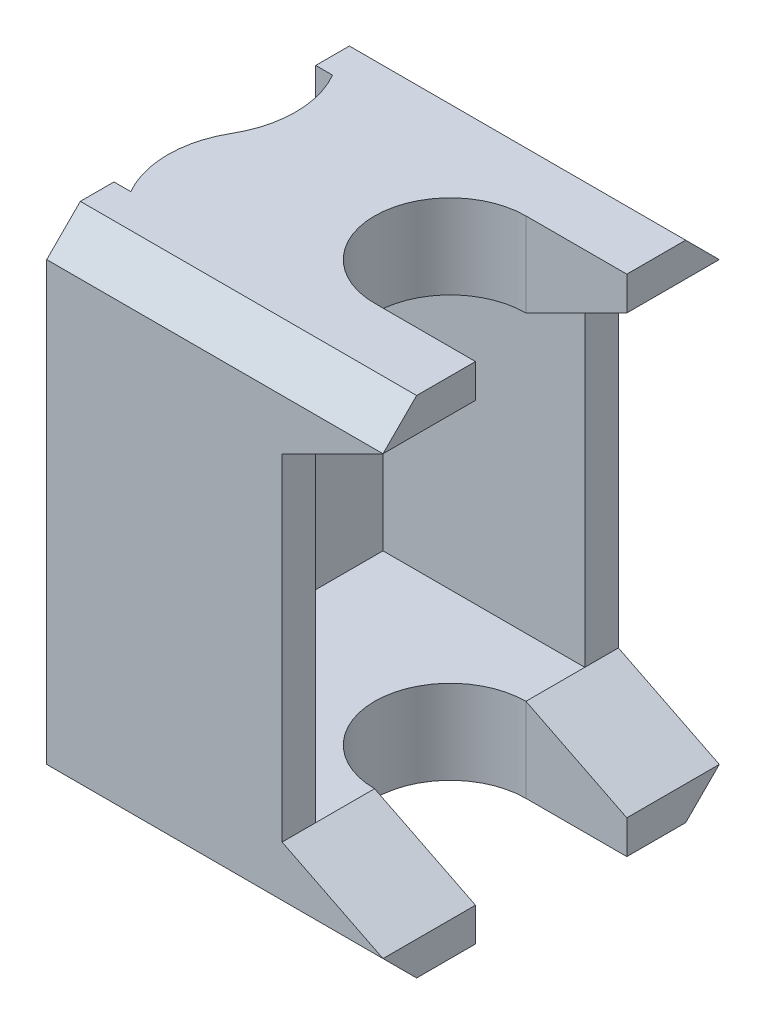
ISO-10303-21;
HEADER;
FILE_DESCRIPTION(('STEP AP214'),'2;1');
FILE_NAME('part.step','',(''),(''),'','','');
FILE_SCHEMA(('AUTOMOTIVE_DESIGN { 1 0 10303 214 1 1 1 1 }'));
ENDSEC;
DATA;
#1=APPLICATION_CONTEXT('core data for automotive mechanical design processes');
#2=APPLICATION_PROTOCOL_DEFINITION('international standard','automotive_design',2000,#1);
#3=PRODUCT_CONTEXT('',#1,'mechanical');
#4=PRODUCT('Part','Part','',(#3));
#5=PRODUCT_RELATED_PRODUCT_CATEGORY('part','',(#4));
#6=PRODUCT_DEFINITION_FORMATION('','',#4);
#7=PRODUCT_DEFINITION_CONTEXT('part definition',#1,'design');
#8=PRODUCT_DEFINITION('design','',#6,#7);
#9=PRODUCT_DEFINITION_SHAPE('','',#8);
#10=(LENGTH_UNIT() NAMED_UNIT(*) SI_UNIT(.MILLI.,.METRE.));
#11=(NAMED_UNIT(*) PLANE_ANGLE_UNIT() SI_UNIT($,.RADIAN.));
#12=(NAMED_UNIT(*) SI_UNIT($,.STERADIAN.) SOLID_ANGLE_UNIT());
#13=UNCERTAINTY_MEASURE_WITH_UNIT(LENGTH_MEASURE(1.E-05),#10,'distance_accuracy_value','');
#14=(GEOMETRIC_REPRESENTATION_CONTEXT(3) GLOBAL_UNCERTAINTY_ASSIGNED_CONTEXT((#13)) GLOBAL_UNIT_ASSIGNED_CONTEXT((#10,
#11,#12)) REPRESENTATION_CONTEXT('',''));
#15=CARTESIAN_POINT('',(0.,0.,0.));
#16=DIRECTION('',(0.,0.,1.));
#17=DIRECTION('',(1.,0.,0.));
#18=AXIS2_PLACEMENT_3D('',#15,#16,#17);
#19=CARTESIAN_POINT('',(-30.,0.,0.));
#20=DIRECTION('',(0.,1.,0.));
#21=DIRECTION('',(-1.,0.,0.));
#22=AXIS2_PLACEMENT_3D('',#19,#20,#21);
#23=CYLINDRICAL_SURFACE('',#22,22.5);
#24=CARTESIAN_POINT('',(-30.,125.,0.));
#25=DIRECTION('',(0.,1.,0.));
#26=DIRECTION('',(0.,0.,1.));
#27=AXIS2_PLACEMENT_3D('',#24,#25,#26);
#28=CIRCLE('',#27,22.5);
#29=CARTESIAN_POINT('',(-30.,125.,-22.5));
#30=VERTEX_POINT('',#29);
#31=CARTESIAN_POINT('',(-30.,125.,22.5));
#32=VERTEX_POINT('',#31);
#33=EDGE_CURVE('E11',#30,#32,#28,.T.);
#34=ORIENTED_EDGE('',*,*,#33,.F.);
#35=DIRECTION('',(0.,1.,0.));
#36=VECTOR('',#35,1.);
#37=CARTESIAN_POINT('',(-30.,0.,-22.5));
#38=LINE('',#37,#36);
#39=CARTESIAN_POINT('',(-30.,150.,-22.5));
#40=VERTEX_POINT('',#39);
#41=EDGE_CURVE('E305',#30,#40,#38,.T.);
#42=ORIENTED_EDGE('',*,*,#41,.T.);
#43=CARTESIAN_POINT('',(-30.,150.,0.));
#44=DIRECTION('',(0.,-1.,0.));
#45=DIRECTION('',(1.,0.,0.));
#46=AXIS2_PLACEMENT_3D('',#43,#44,#45);
#47=CIRCLE('',#46,22.5);
#48=CARTESIAN_POINT('',(-30.,150.,22.5));
#49=VERTEX_POINT('',#48);
#50=EDGE_CURVE('E387',#49,#40,#47,.T.);
#51=ORIENTED_EDGE('',*,*,#50,.F.);
#52=DIRECTION('',(0.,1.,0.));
#53=VECTOR('',#52,1.);
#54=CARTESIAN_POINT('',(-30.,0.,22.5));
#55=LINE('',#54,#53);
#56=EDGE_CURVE('E304',#32,#49,#55,.T.);
#57=ORIENTED_EDGE('',*,*,#56,.F.);
#58=EDGE_LOOP('',(#34,#42,#51,#57));
#59=FACE_BOUND('',#58,.T.);
#60=ADVANCED_FACE('F37',(#59),#23,.F.);
#61=CARTESIAN_POINT('',(-100.,0.,50.));
#62=DIRECTION('',(0.,1.,0.));
#63=DIRECTION('',(0.,0.,1.));
#64=AXIS2_PLACEMENT_3D('',#61,#62,#63);
#65=PLANE('',#64);
#66=DIRECTION('',(0.,0.,-1.));
#67=VECTOR('',#66,1.);
#68=CARTESIAN_POINT('',(0.,0.,50.));
#69=LINE('',#68,#67);
#70=CARTESIAN_POINT('',(0.,0.,40.0000000000001));
#71=VERTEX_POINT('',#70);
#72=CARTESIAN_POINT('',(0.,0.,22.5));
#73=VERTEX_POINT('',#72);
#74=EDGE_CURVE('E273',#71,#73,#69,.T.);
#75=ORIENTED_EDGE('',*,*,#74,.F.);
#76=DIRECTION('',(1.,0.,0.));
#77=VECTOR('',#76,1.);
#78=CARTESIAN_POINT('',(-100.,0.,40.0000000000001));
#79=LINE('',#78,#77);
#80=CARTESIAN_POINT('',(-100.,0.,40.0000000000001));
#81=VERTEX_POINT('',#80);
#82=EDGE_CURVE('E435',#81,#71,#79,.T.);
#83=ORIENTED_EDGE('',*,*,#82,.F.);
#84=DIRECTION('',(0.,0.,-1.));
#85=VECTOR('',#84,1.);
#86=CARTESIAN_POINT('',(-100.,0.,50.));
#87=LINE('',#86,#85);
#88=CARTESIAN_POINT('',(-100.,0.,30.));
#89=VERTEX_POINT('',#88);
#90=EDGE_CURVE('E239',#81,#89,#87,.T.);
#91=ORIENTED_EDGE('',*,*,#90,.T.);
#92=DIRECTION('',(1.,0.,0.));
#93=VECTOR('',#92,1.);
#94=CARTESIAN_POINT('',(-100.,0.,30.));
#95=LINE('',#94,#93);
#96=CARTESIAN_POINT('',(-95.,0.,30.));
#97=VERTEX_POINT('',#96);
#98=EDGE_CURVE('E345',#89,#97,#95,.T.);
#99=ORIENTED_EDGE('',*,*,#98,.T.);
#100=CARTESIAN_POINT('',(-69.0192378864668,0.,15.));
#101=DIRECTION('',(0.,-1.,0.));
#102=DIRECTION('',(1.,0.,0.));
#103=AXIS2_PLACEMENT_3D('',#100,#101,#102);
#104=CIRCLE('',#103,30.);
#105=CARTESIAN_POINT('',(-95.,0.,0.));
#106=VERTEX_POINT('',#105);
#107=EDGE_CURVE('E348',#97,#106,#104,.T.);
#108=ORIENTED_EDGE('',*,*,#107,.T.);
#109=CARTESIAN_POINT('',(-120.980762113533,0.,-15.));
#110=DIRECTION('',(0.,1.,0.));
#111=DIRECTION('',(-1.,0.,0.));
#112=AXIS2_PLACEMENT_3D('',#109,#110,#111);
#113=CIRCLE('',#112,30.);
#114=CARTESIAN_POINT('',(-95.,0.,-30.));
#115=VERTEX_POINT('',#114);
#116=EDGE_CURVE('E351',#106,#115,#113,.T.);
#117=ORIENTED_EDGE('',*,*,#116,.T.);
#118=DIRECTION('',(-1.,0.,0.));
#119=VECTOR('',#118,1.);
#120=CARTESIAN_POINT('',(-95.,0.,-30.));
#121=LINE('',#120,#119);
#122=CARTESIAN_POINT('',(-100.,0.,-30.));
#123=VERTEX_POINT('',#122);
#124=EDGE_CURVE('E238',#115,#123,#121,.T.);
#125=ORIENTED_EDGE('',*,*,#124,.T.);
#126=CARTESIAN_POINT('',(-100.,0.,-40.0000000000001));
#127=VERTEX_POINT('',#126);
#128=EDGE_CURVE('E229',#123,#127,#87,.T.);
#129=ORIENTED_EDGE('',*,*,#128,.T.);
#130=DIRECTION('',(1.,0.,0.));
#131=VECTOR('',#130,1.);
#132=CARTESIAN_POINT('',(-100.,0.,-40.0000000000001));
#133=LINE('',#132,#131);
#134=CARTESIAN_POINT('',(0.,0.,-40.0000000000001));
#135=VERTEX_POINT('',#134);
#136=EDGE_CURVE('E213',#127,#135,#133,.T.);
#137=ORIENTED_EDGE('',*,*,#136,.T.);
#138=CARTESIAN_POINT('',(0.,0.,-22.5));
#139=VERTEX_POINT('',#138);
#140=EDGE_CURVE('E272',#139,#135,#69,.T.);
#141=ORIENTED_EDGE('',*,*,#140,.F.);
#142=DIRECTION('',(-1.,0.,0.));
#143=VECTOR('',#142,1.);
#144=CARTESIAN_POINT('',(0.,0.,-22.5));
#145=LINE('',#144,#143);
#146=CARTESIAN_POINT('',(-30.,0.,-22.5));
#147=VERTEX_POINT('',#146);
#148=EDGE_CURVE('E392',#139,#147,#145,.T.);
#149=ORIENTED_EDGE('',*,*,#148,.T.);
#150=CARTESIAN_POINT('',(-30.,0.,0.));
#151=DIRECTION('',(0.,-1.,0.));
#152=DIRECTION('',(1.,0.,0.));
#153=AXIS2_PLACEMENT_3D('',#150,#151,#152);
#154=CIRCLE('',#153,22.5);
#155=CARTESIAN_POINT('',(-30.,0.,22.5));
#156=VERTEX_POINT('',#155);
#157=EDGE_CURVE('E303',#156,#147,#154,.T.);
#158=ORIENTED_EDGE('',*,*,#157,.F.);
#159=DIRECTION('',(-1.,0.,0.));
#160=VECTOR('',#159,1.);
#161=CARTESIAN_POINT('',(0.,0.,22.5));
#162=LINE('',#161,#160);
#163=EDGE_CURVE('E386',#73,#156,#162,.T.);
#164=ORIENTED_EDGE('',*,*,#163,.F.);
#165=EDGE_LOOP('',(#75,#83,#91,#99,#108,#117,#125,#129,#137,#141,#149,#158,#164));
#166=FACE_BOUND('',#165,.T.);
#167=ADVANCED_FACE('F39',(#166),#65,.F.);
#168=CARTESIAN_POINT('',(0.,0.,50.));
#169=DIRECTION('',(-1.,0.,0.));
#170=DIRECTION('',(0.,0.,1.));
#171=AXIS2_PLACEMENT_3D('',#168,#169,#170);
#172=PLANE('',#171);
#173=DIRECTION('',(0.,0.,-1.));
#174=VECTOR('',#173,1.);
#175=CARTESIAN_POINT('',(0.,10.,50.));
#176=LINE('',#175,#174);
#177=CARTESIAN_POINT('',(0.,10.,50.));
#178=VERTEX_POINT('',#177);
#179=CARTESIAN_POINT('',(0.,9.99999999999998,22.5));
#180=VERTEX_POINT('',#179);
#181=EDGE_CURVE('E269',#178,#180,#176,.T.);
#182=ORIENTED_EDGE('',*,*,#181,.F.);
#183=DIRECTION('',(0.,0.707106781186551,0.707106781186544));
#184=VECTOR('',#183,1.);
#185=CARTESIAN_POINT('',(0.,0.,40.0000000000001));
#186=LINE('',#185,#184);
#187=EDGE_CURVE('E439',#71,#178,#186,.T.);
#188=ORIENTED_EDGE('',*,*,#187,.F.);
#189=ORIENTED_EDGE('',*,*,#74,.T.);
#190=DIRECTION('',(0.,1.,0.));
#191=VECTOR('',#190,1.);
#192=CARTESIAN_POINT('',(0.,0.,22.5));
#193=LINE('',#192,#191);
#194=EDGE_CURVE('E379',#73,#180,#193,.T.);
#195=ORIENTED_EDGE('',*,*,#194,.T.);
#196=EDGE_LOOP('',(#182,#188,#189,#195));
#197=FACE_BOUND('',#196,.T.);
#198=ADVANCED_FACE('F460',(#197),#172,.F.);
#199=CARTESIAN_POINT('',(0.,10.,50.));
#200=DIRECTION('',(-0.447213595499958,-0.894427190999916,0.));
#201=DIRECTION('',(0.894427190999916,-0.447213595499958,0.));
#202=AXIS2_PLACEMENT_3D('',#199,#200,#201);
#203=PLANE('',#202);
#204=DIRECTION('',(0.894427190999916,-0.447213595499958,0.));
#205=VECTOR('',#204,1.);
#206=CARTESIAN_POINT('',(0.,10.,22.5));
#207=LINE('',#206,#205);
#208=CARTESIAN_POINT('',(-30.,25.,22.5));
#209=VERTEX_POINT('',#208);
#210=EDGE_CURVE('E323',#209,#180,#207,.T.);
#211=ORIENTED_EDGE('',*,*,#210,.F.);
#212=DIRECTION('',(0.,0.,-1.));
#213=VECTOR('',#212,1.);
#214=CARTESIAN_POINT('',(-30.,25.,40.));
#215=LINE('',#214,#213);
#216=CARTESIAN_POINT('',(-30.,25.,40.));
#217=VERTEX_POINT('',#216);
#218=EDGE_CURVE('E281',#217,#209,#215,.T.);
#219=ORIENTED_EDGE('',*,*,#218,.F.);
#220=DIRECTION('',(0.,0.,-1.));
#221=VECTOR('',#220,1.);
#222=CARTESIAN_POINT('',(-30.,25.,50.));
#223=LINE('',#222,#221);
#224=CARTESIAN_POINT('',(-30.,25.,50.));
#225=VERTEX_POINT('',#224);
#226=EDGE_CURVE('E264',#225,#217,#223,.T.);
#227=ORIENTED_EDGE('',*,*,#226,.F.);
#228=DIRECTION('',(-0.894427190999916,0.447213595499958,0.));
#229=VECTOR('',#228,1.);
#230=CARTESIAN_POINT('',(0.,10.,50.));
#231=LINE('',#230,#229);
#232=EDGE_CURVE('E335',#178,#225,#231,.T.);
#233=ORIENTED_EDGE('',*,*,#232,.F.);
#234=ORIENTED_EDGE('',*,*,#181,.T.);
#235=EDGE_LOOP('',(#211,#219,#227,#233,#234));
#236=FACE_BOUND('',#235,.T.);
#237=ADVANCED_FACE('F464',(#236),#203,.F.);
#238=CARTESIAN_POINT('',(-30.,25.,50.));
#239=DIRECTION('',(-1.,0.,0.));
#240=DIRECTION('',(0.,0.,1.));
#241=AXIS2_PLACEMENT_3D('',#238,#239,#240);
#242=PLANE('',#241);
#243=ORIENTED_EDGE('',*,*,#226,.T.);
#244=DIRECTION('',(0.,-1.,0.));
#245=VECTOR('',#244,1.);
#246=CARTESIAN_POINT('',(-30.,25.,40.));
#247=LINE('',#246,#245);
#248=CARTESIAN_POINT('',(-30.,125.,40.));
#249=VERTEX_POINT('',#248);
#250=EDGE_CURVE('E410',#249,#217,#247,.T.);
#251=ORIENTED_EDGE('',*,*,#250,.F.);
#252=DIRECTION('',(0.,0.,-1.));
#253=VECTOR('',#252,1.);
#254=CARTESIAN_POINT('',(-30.,125.,50.));
#255=LINE('',#254,#253);
#256=CARTESIAN_POINT('',(-30.,125.,50.));
#257=VERTEX_POINT('',#256);
#258=EDGE_CURVE('E259',#257,#249,#255,.T.);
#259=ORIENTED_EDGE('',*,*,#258,.F.);
#260=DIRECTION('',(0.,1.,0.));
#261=VECTOR('',#260,1.);
#262=CARTESIAN_POINT('',(-30.,25.,50.));
#263=LINE('',#262,#261);
#264=EDGE_CURVE('E333',#225,#257,#263,.T.);
#265=ORIENTED_EDGE('',*,*,#264,.F.);
#266=EDGE_LOOP('',(#243,#251,#259,#265));
#267=FACE_BOUND('',#266,.T.);
#268=ADVANCED_FACE('F539',(#267),#242,.F.);
#269=CARTESIAN_POINT('',(-30.,125.,50.));
#270=DIRECTION('',(-0.447213595499958,0.894427190999916,0.));
#271=DIRECTION('',(-0.894427190999916,-0.447213595499958,0.));
#272=AXIS2_PLACEMENT_3D('',#269,#270,#271);
#273=PLANE('',#272);
#274=DIRECTION('',(-0.894427190999916,-0.447213595499958,0.));
#275=VECTOR('',#274,1.);
#276=CARTESIAN_POINT('',(-30.,125.,22.5));
#277=LINE('',#276,#275);
#278=CARTESIAN_POINT('',(0.,140.,22.5));
#279=VERTEX_POINT('',#278);
#280=EDGE_CURVE('E298',#279,#32,#277,.T.);
#281=ORIENTED_EDGE('',*,*,#280,.F.);
#282=DIRECTION('',(0.,0.,-1.));
#283=VECTOR('',#282,1.);
#284=CARTESIAN_POINT('',(0.,140.,50.));
#285=LINE('',#284,#283);
#286=CARTESIAN_POINT('',(0.,140.,50.));
#287=VERTEX_POINT('',#286);
#288=EDGE_CURVE('E255',#287,#279,#285,.T.);
#289=ORIENTED_EDGE('',*,*,#288,.F.);
#290=DIRECTION('',(0.894427190999916,0.447213595499958,0.));
#291=VECTOR('',#290,1.);
#292=CARTESIAN_POINT('',(-30.,125.,50.));
#293=LINE('',#292,#291);
#294=EDGE_CURVE('E244',#257,#287,#293,.T.);
#295=ORIENTED_EDGE('',*,*,#294,.F.);
#296=ORIENTED_EDGE('',*,*,#258,.T.);
#297=DIRECTION('',(0.,0.,1.));
#298=VECTOR('',#297,1.);
#299=CARTESIAN_POINT('',(-30.,125.,40.));
#300=LINE('',#299,#298);
#301=EDGE_CURVE('E405',#32,#249,#300,.T.);
#302=ORIENTED_EDGE('',*,*,#301,.F.);
#303=EDGE_LOOP('',(#281,#289,#295,#296,#302));
#304=FACE_BOUND('',#303,.T.);
#305=ADVANCED_FACE('F533',(#304),#273,.F.);
#306=CARTESIAN_POINT('',(0.,140.,50.));
#307=DIRECTION('',(-1.,0.,0.));
#308=DIRECTION('',(0.,-1.,0.));
#309=AXIS2_PLACEMENT_3D('',#306,#307,#308);
#310=PLANE('',#309);
#311=DIRECTION('',(0.,0.,-1.));
#312=VECTOR('',#311,1.);
#313=CARTESIAN_POINT('',(0.,150.,50.));
#314=LINE('',#313,#312);
#315=CARTESIAN_POINT('',(0.,150.,40.));
#316=VERTEX_POINT('',#315);
#317=CARTESIAN_POINT('',(0.,150.,22.5));
#318=VERTEX_POINT('',#317);
#319=EDGE_CURVE('E252',#316,#318,#314,.T.);
#320=ORIENTED_EDGE('',*,*,#319,.F.);
#321=DIRECTION('',(0.,0.707106781186546,-0.707106781186549));
#322=VECTOR('',#321,1.);
#323=CARTESIAN_POINT('',(0.,140.,50.));
#324=LINE('',#323,#322);
#325=EDGE_CURVE('E428',#287,#316,#324,.T.);
#326=ORIENTED_EDGE('',*,*,#325,.F.);
#327=ORIENTED_EDGE('',*,*,#288,.T.);
#328=EDGE_CURVE('E382',#279,#318,#193,.T.);
#329=ORIENTED_EDGE('',*,*,#328,.T.);
#330=EDGE_LOOP('',(#320,#326,#327,#329));
#331=FACE_BOUND('',#330,.T.);
#332=ADVANCED_FACE('F528',(#331),#310,.F.);
#333=CARTESIAN_POINT('',(0.,150.,50.));
#334=DIRECTION('',(0.,-1.,0.));
#335=DIRECTION('',(1.,0.,0.));
#336=AXIS2_PLACEMENT_3D('',#333,#334,#335);
#337=PLANE('',#336);
#338=CARTESIAN_POINT('',(0.,150.,-22.5));
#339=VERTEX_POINT('',#338);
#340=CARTESIAN_POINT('',(0.,150.,-40.0000000000001));
#341=VERTEX_POINT('',#340);
#342=EDGE_CURVE('E251',#339,#341,#314,.T.);
#343=ORIENTED_EDGE('',*,*,#342,.T.);
#344=DIRECTION('',(1.,0.,0.));
#345=VECTOR('',#344,1.);
#346=CARTESIAN_POINT('',(-100.,150.,-40.0000000000001));
#347=LINE('',#346,#345);
#348=CARTESIAN_POINT('',(-100.,150.,-40.0000000000001));
#349=VERTEX_POINT('',#348);
#350=EDGE_CURVE('E430',#349,#341,#347,.T.);
#351=ORIENTED_EDGE('',*,*,#350,.F.);
#352=DIRECTION('',(0.,0.,-1.));
#353=VECTOR('',#352,1.);
#354=CARTESIAN_POINT('',(-100.,150.,50.));
#355=LINE('',#354,#353);
#356=CARTESIAN_POINT('',(-100.,150.,-30.));
#357=VERTEX_POINT('',#356);
#358=EDGE_CURVE('E242',#357,#349,#355,.T.);
#359=ORIENTED_EDGE('',*,*,#358,.F.);
#360=DIRECTION('',(-1.,0.,0.));
#361=VECTOR('',#360,1.);
#362=CARTESIAN_POINT('',(-95.,150.,-30.));
#363=LINE('',#362,#361);
#364=CARTESIAN_POINT('',(-95.,150.,-30.));
#365=VERTEX_POINT('',#364);
#366=EDGE_CURVE('E354',#365,#357,#363,.T.);
#367=ORIENTED_EDGE('',*,*,#366,.F.);
#368=CARTESIAN_POINT('',(-120.980762113533,150.,-15.));
#369=DIRECTION('',(0.,1.,0.));
#370=DIRECTION('',(-1.,0.,0.));
#371=AXIS2_PLACEMENT_3D('',#368,#369,#370);
#372=CIRCLE('',#371,30.);
#373=CARTESIAN_POINT('',(-95.,150.,0.));
#374=VERTEX_POINT('',#373);
#375=EDGE_CURVE('E344',#374,#365,#372,.T.);
#376=ORIENTED_EDGE('',*,*,#375,.F.);
#377=CARTESIAN_POINT('',(-69.0192378864668,150.,15.));
#378=DIRECTION('',(0.,-1.,0.));
#379=DIRECTION('',(1.,0.,0.));
#380=AXIS2_PLACEMENT_3D('',#377,#378,#379);
#381=CIRCLE('',#380,30.);
#382=CARTESIAN_POINT('',(-95.,150.,30.));
#383=VERTEX_POINT('',#382);
#384=EDGE_CURVE('E360',#383,#374,#381,.T.);
#385=ORIENTED_EDGE('',*,*,#384,.F.);
#386=DIRECTION('',(1.,0.,0.));
#387=VECTOR('',#386,1.);
#388=CARTESIAN_POINT('',(-100.,150.,30.));
#389=LINE('',#388,#387);
#390=CARTESIAN_POINT('',(-100.,150.,30.));
#391=VERTEX_POINT('',#390);
#392=EDGE_CURVE('E357',#391,#383,#389,.T.);
#393=ORIENTED_EDGE('',*,*,#392,.F.);
#394=CARTESIAN_POINT('',(-100.,150.,40.));
#395=VERTEX_POINT('',#394);
#396=EDGE_CURVE('E249',#395,#391,#355,.T.);
#397=ORIENTED_EDGE('',*,*,#396,.F.);
#398=DIRECTION('',(1.,0.,0.));
#399=VECTOR('',#398,1.);
#400=CARTESIAN_POINT('',(-100.,150.,40.));
#401=LINE('',#400,#399);
#402=EDGE_CURVE('E413',#395,#316,#401,.T.);
#403=ORIENTED_EDGE('',*,*,#402,.T.);
#404=ORIENTED_EDGE('',*,*,#319,.T.);
#405=DIRECTION('',(-1.,0.,0.));
#406=VECTOR('',#405,1.);
#407=CARTESIAN_POINT('',(0.,150.,22.5));
#408=LINE('',#407,#406);
#409=EDGE_CURVE('E356',#318,#49,#408,.T.);
#410=ORIENTED_EDGE('',*,*,#409,.T.);
#411=ORIENTED_EDGE('',*,*,#50,.T.);
#412=DIRECTION('',(-1.,0.,0.));
#413=VECTOR('',#412,1.);
#414=CARTESIAN_POINT('',(0.,150.,-22.5));
#415=LINE('',#414,#413);
#416=EDGE_CURVE('E383',#339,#40,#415,.T.);
#417=ORIENTED_EDGE('',*,*,#416,.F.);
#418=EDGE_LOOP('',(#343,#351,#359,#367,#376,#385,#393,#397,#403,#404,#410,#411,#417));
#419=FACE_BOUND('',#418,.T.);
#420=ADVANCED_FACE('F496',(#419),#337,.F.);
#421=CARTESIAN_POINT('',(-100.,150.,50.));
#422=DIRECTION('',(1.,0.,0.));
#423=DIRECTION('',(0.,1.,0.));
#424=AXIS2_PLACEMENT_3D('',#421,#422,#423);
#425=PLANE('',#424);
#426=ORIENTED_EDGE('',*,*,#358,.T.);
#427=DIRECTION('',(0.,-0.707106781186551,-0.707106781186544));
#428=VECTOR('',#427,1.);
#429=CARTESIAN_POINT('',(-100.,150.,-40.0000000000001));
#430=LINE('',#429,#428);
#431=CARTESIAN_POINT('',(-100.,140.,-50.));
#432=VERTEX_POINT('',#431);
#433=EDGE_CURVE('E445',#349,#432,#430,.T.);
#434=ORIENTED_EDGE('',*,*,#433,.T.);
#435=DIRECTION('',(0.,-1.,0.));
#436=VECTOR('',#435,1.);
#437=CARTESIAN_POINT('',(-100.,150.,-50.));
#438=LINE('',#437,#436);
#439=CARTESIAN_POINT('',(-100.,10.,-50.));
#440=VERTEX_POINT('',#439);
#441=EDGE_CURVE('E232',#432,#440,#438,.T.);
#442=ORIENTED_EDGE('',*,*,#441,.T.);
#443=DIRECTION('',(0.,-0.707106781186551,0.707106781186544));
#444=VECTOR('',#443,1.);
#445=CARTESIAN_POINT('',(-100.,10.,-50.));
#446=LINE('',#445,#444);
#447=EDGE_CURVE('E60',#440,#127,#446,.T.);
#448=ORIENTED_EDGE('',*,*,#447,.T.);
#449=ORIENTED_EDGE('',*,*,#128,.F.);
#450=DIRECTION('',(0.,1.,0.));
#451=VECTOR('',#450,1.);
#452=CARTESIAN_POINT('',(-100.,0.,-30.));
#453=LINE('',#452,#451);
#454=EDGE_CURVE('E353',#123,#357,#453,.T.);
#455=ORIENTED_EDGE('',*,*,#454,.T.);
#456=EDGE_LOOP('',(#426,#434,#442,#448,#449,#455));
#457=FACE_BOUND('',#456,.T.);
#458=ADVANCED_FACE('F227',(#457),#425,.F.);
#459=ORIENTED_EDGE('',*,*,#140,.T.);
#460=DIRECTION('',(0.,-0.707106781186551,0.707106781186544));
#461=VECTOR('',#460,1.);
#462=CARTESIAN_POINT('',(0.,10.,-50.));
#463=LINE('',#462,#461);
#464=CARTESIAN_POINT('',(0.,10.,-50.));
#465=VERTEX_POINT('',#464);
#466=EDGE_CURVE('E216',#465,#135,#463,.T.);
#467=ORIENTED_EDGE('',*,*,#466,.F.);
#468=CARTESIAN_POINT('',(0.,9.99999999999998,-22.5));
#469=VERTEX_POINT('',#468);
#470=EDGE_CURVE('E267',#469,#465,#176,.T.);
#471=ORIENTED_EDGE('',*,*,#470,.F.);
#472=DIRECTION('',(0.,1.,0.));
#473=VECTOR('',#472,1.);
#474=CARTESIAN_POINT('',(0.,0.,-22.5));
#475=LINE('',#474,#473);
#476=EDGE_CURVE('E294',#139,#469,#475,.T.);
#477=ORIENTED_EDGE('',*,*,#476,.F.);
#478=EDGE_LOOP('',(#459,#467,#471,#477));
#479=FACE_BOUND('',#478,.T.);
#480=ADVANCED_FACE('F451',(#479),#172,.F.);
#481=CARTESIAN_POINT('',(-30.,25.,-22.5));
#482=VERTEX_POINT('',#481);
#483=CARTESIAN_POINT('',(-30.,25.,-40.));
#484=VERTEX_POINT('',#483);
#485=EDGE_CURVE('E268',#482,#484,#223,.T.);
#486=ORIENTED_EDGE('',*,*,#485,.F.);
#487=DIRECTION('',(0.894427190999916,-0.447213595499958,0.));
#488=VECTOR('',#487,1.);
#489=CARTESIAN_POINT('',(0.,10.,-22.5));
#490=LINE('',#489,#488);
#491=EDGE_CURVE('E289',#482,#469,#490,.T.);
#492=ORIENTED_EDGE('',*,*,#491,.T.);
#493=ORIENTED_EDGE('',*,*,#470,.T.);
#494=DIRECTION('',(-0.894427190999916,0.447213595499958,0.));
#495=VECTOR('',#494,1.);
#496=CARTESIAN_POINT('',(0.,10.,-50.));
#497=LINE('',#496,#495);
#498=CARTESIAN_POINT('',(-30.,25.,-50.));
#499=VERTEX_POINT('',#498);
#500=EDGE_CURVE('E321',#465,#499,#497,.T.);
#501=ORIENTED_EDGE('',*,*,#500,.T.);
#502=EDGE_CURVE('E262',#484,#499,#223,.T.);
#503=ORIENTED_EDGE('',*,*,#502,.F.);
#504=EDGE_LOOP('',(#486,#492,#493,#501,#503));
#505=FACE_BOUND('',#504,.T.);
#506=ADVANCED_FACE('F308',(#505),#203,.F.);
#507=CARTESIAN_POINT('',(-30.,125.,-40.));
#508=VERTEX_POINT('',#507);
#509=CARTESIAN_POINT('',(-30.,125.,-50.));
#510=VERTEX_POINT('',#509);
#511=EDGE_CURVE('E258',#508,#510,#255,.T.);
#512=ORIENTED_EDGE('',*,*,#511,.F.);
#513=DIRECTION('',(0.,1.,0.));
#514=VECTOR('',#513,1.);
#515=CARTESIAN_POINT('',(-30.,25.,-40.));
#516=LINE('',#515,#514);
#517=EDGE_CURVE('E319',#484,#508,#516,.T.);
#518=ORIENTED_EDGE('',*,*,#517,.F.);
#519=ORIENTED_EDGE('',*,*,#502,.T.);
#520=DIRECTION('',(0.,1.,0.));
#521=VECTOR('',#520,1.);
#522=CARTESIAN_POINT('',(-30.,25.,-50.));
#523=LINE('',#522,#521);
#524=EDGE_CURVE('E316',#499,#510,#523,.T.);
#525=ORIENTED_EDGE('',*,*,#524,.T.);
#526=EDGE_LOOP('',(#512,#518,#519,#525));
#527=FACE_BOUND('',#526,.T.);
#528=ADVANCED_FACE('F314',(#527),#242,.F.);
#529=CARTESIAN_POINT('',(0.,140.,-22.5));
#530=VERTEX_POINT('',#529);
#531=CARTESIAN_POINT('',(0.,140.,-50.));
#532=VERTEX_POINT('',#531);
#533=EDGE_CURVE('E254',#530,#532,#285,.T.);
#534=ORIENTED_EDGE('',*,*,#533,.F.);
#535=DIRECTION('',(-0.894427190999916,-0.447213595499958,0.));
#536=VECTOR('',#535,1.);
#537=CARTESIAN_POINT('',(-30.,125.,-22.5));
#538=LINE('',#537,#536);
#539=EDGE_CURVE('E299',#530,#30,#538,.T.);
#540=ORIENTED_EDGE('',*,*,#539,.T.);
#541=EDGE_CURVE('E263',#30,#508,#255,.T.);
#542=ORIENTED_EDGE('',*,*,#541,.T.);
#543=ORIENTED_EDGE('',*,*,#511,.T.);
#544=DIRECTION('',(0.894427190999916,0.447213595499958,0.));
#545=VECTOR('',#544,1.);
#546=CARTESIAN_POINT('',(-30.,125.,-50.));
#547=LINE('',#546,#545);
#548=EDGE_CURVE('E328',#510,#532,#547,.T.);
#549=ORIENTED_EDGE('',*,*,#548,.T.);
#550=EDGE_LOOP('',(#534,#540,#542,#543,#549));
#551=FACE_BOUND('',#550,.T.);
#552=ADVANCED_FACE('F508',(#551),#273,.F.);
#553=ORIENTED_EDGE('',*,*,#533,.T.);
#554=DIRECTION('',(0.,-0.707106781186551,-0.707106781186544));
#555=VECTOR('',#554,1.);
#556=CARTESIAN_POINT('',(0.,150.,-40.0000000000001));
#557=LINE('',#556,#555);
#558=EDGE_CURVE('E438',#341,#532,#557,.T.);
#559=ORIENTED_EDGE('',*,*,#558,.F.);
#560=ORIENTED_EDGE('',*,*,#342,.F.);
#561=EDGE_CURVE('E378',#530,#339,#475,.T.);
#562=ORIENTED_EDGE('',*,*,#561,.F.);
#563=EDGE_LOOP('',(#553,#559,#560,#562));
#564=FACE_BOUND('',#563,.T.);
#565=ADVANCED_FACE('F504',(#564),#310,.F.);
#566=ORIENTED_EDGE('',*,*,#90,.F.);
#567=DIRECTION('',(0.,0.707106781186551,0.707106781186544));
#568=VECTOR('',#567,1.);
#569=CARTESIAN_POINT('',(-100.,0.,40.0000000000001));
#570=LINE('',#569,#568);
#571=CARTESIAN_POINT('',(-100.,10.,50.));
#572=VERTEX_POINT('',#571);
#573=EDGE_CURVE('E436',#81,#572,#570,.T.);
#574=ORIENTED_EDGE('',*,*,#573,.T.);
#575=DIRECTION('',(0.,-1.,0.));
#576=VECTOR('',#575,1.);
#577=CARTESIAN_POINT('',(-100.,150.,50.));
#578=LINE('',#577,#576);
#579=CARTESIAN_POINT('',(-100.,140.,50.));
#580=VERTEX_POINT('',#579);
#581=EDGE_CURVE('E240',#580,#572,#578,.T.);
#582=ORIENTED_EDGE('',*,*,#581,.F.);
#583=DIRECTION('',(0.,0.707106781186546,-0.707106781186549));
#584=VECTOR('',#583,1.);
#585=CARTESIAN_POINT('',(-100.,140.,50.));
#586=LINE('',#585,#584);
#587=EDGE_CURVE('E52',#580,#395,#586,.T.);
#588=ORIENTED_EDGE('',*,*,#587,.T.);
#589=ORIENTED_EDGE('',*,*,#396,.T.);
#590=DIRECTION('',(0.,1.,0.));
#591=VECTOR('',#590,1.);
#592=CARTESIAN_POINT('',(-100.,0.,30.));
#593=LINE('',#592,#591);
#594=EDGE_CURVE('E372',#89,#391,#593,.T.);
#595=ORIENTED_EDGE('',*,*,#594,.F.);
#596=EDGE_LOOP('',(#566,#574,#582,#588,#589,#595));
#597=FACE_BOUND('',#596,.T.);
#598=ADVANCED_FACE('F475',(#597),#425,.F.);
#599=CARTESIAN_POINT('',(0.,0.,50.));
#600=DIRECTION('',(0.,0.,1.));
#601=DIRECTION('',(1.,0.,0.));
#602=AXIS2_PLACEMENT_3D('',#599,#600,#601);
#603=PLANE('',#602);
#604=DIRECTION('',(1.,0.,0.));
#605=VECTOR('',#604,1.);
#606=CARTESIAN_POINT('',(-100.,10.,50.));
#607=LINE('',#606,#605);
#608=EDGE_CURVE('E432',#572,#178,#607,.T.);
#609=ORIENTED_EDGE('',*,*,#608,.T.);
#610=ORIENTED_EDGE('',*,*,#232,.T.);
#611=ORIENTED_EDGE('',*,*,#264,.T.);
#612=ORIENTED_EDGE('',*,*,#294,.T.);
#613=DIRECTION('',(1.,0.,0.));
#614=VECTOR('',#613,1.);
#615=CARTESIAN_POINT('',(-100.,140.,50.));
#616=LINE('',#615,#614);
#617=EDGE_CURVE('E424',#580,#287,#616,.T.);
#618=ORIENTED_EDGE('',*,*,#617,.F.);
#619=ORIENTED_EDGE('',*,*,#581,.T.);
#620=EDGE_LOOP('',(#609,#610,#611,#612,#618,#619));
#621=FACE_BOUND('',#620,.T.);
#622=ADVANCED_FACE('F468',(#621),#603,.T.);
#623=CARTESIAN_POINT('',(0.,0.,-50.));
#624=DIRECTION('',(0.,0.,1.));
#625=DIRECTION('',(1.,0.,0.));
#626=AXIS2_PLACEMENT_3D('',#623,#624,#625);
#627=PLANE('',#626);
#628=ORIENTED_EDGE('',*,*,#441,.F.);
#629=DIRECTION('',(1.,0.,0.));
#630=VECTOR('',#629,1.);
#631=CARTESIAN_POINT('',(-100.,140.,-50.));
#632=LINE('',#631,#630);
#633=EDGE_CURVE('E443',#432,#532,#632,.T.);
#634=ORIENTED_EDGE('',*,*,#633,.T.);
#635=ORIENTED_EDGE('',*,*,#548,.F.);
#636=ORIENTED_EDGE('',*,*,#524,.F.);
#637=ORIENTED_EDGE('',*,*,#500,.F.);
#638=DIRECTION('',(1.,0.,0.));
#639=VECTOR('',#638,1.);
#640=CARTESIAN_POINT('',(-100.,10.,-50.));
#641=LINE('',#640,#639);
#642=EDGE_CURVE('E221',#440,#465,#641,.T.);
#643=ORIENTED_EDGE('',*,*,#642,.F.);
#644=EDGE_LOOP('',(#628,#634,#635,#636,#637,#643));
#645=FACE_BOUND('',#644,.T.);
#646=ADVANCED_FACE('F325',(#645),#627,.F.);
#647=CARTESIAN_POINT('',(-95.,0.,-30.));
#648=DIRECTION('',(0.,0.,-1.));
#649=DIRECTION('',(-1.,0.,0.));
#650=AXIS2_PLACEMENT_3D('',#647,#648,#649);
#651=PLANE('',#650);
#652=ORIENTED_EDGE('',*,*,#366,.T.);
#653=ORIENTED_EDGE('',*,*,#454,.F.);
#654=ORIENTED_EDGE('',*,*,#124,.F.);
#655=DIRECTION('',(0.,1.,0.));
#656=VECTOR('',#655,1.);
#657=CARTESIAN_POINT('',(-95.,0.,-30.));
#658=LINE('',#657,#656);
#659=EDGE_CURVE('E365',#115,#365,#658,.T.);
#660=ORIENTED_EDGE('',*,*,#659,.T.);
#661=EDGE_LOOP('',(#652,#653,#654,#660));
#662=FACE_BOUND('',#661,.T.);
#663=ADVANCED_FACE('F491',(#662),#651,.F.);
#664=CARTESIAN_POINT('',(-120.980762113533,0.,-15.));
#665=DIRECTION('',(0.,1.,0.));
#666=DIRECTION('',(-1.,0.,0.));
#667=AXIS2_PLACEMENT_3D('',#664,#665,#666);
#668=CYLINDRICAL_SURFACE('',#667,30.);
#669=ORIENTED_EDGE('',*,*,#375,.T.);
#670=ORIENTED_EDGE('',*,*,#659,.F.);
#671=ORIENTED_EDGE('',*,*,#116,.F.);
#672=DIRECTION('',(0.,1.,0.));
#673=VECTOR('',#672,1.);
#674=CARTESIAN_POINT('',(-95.,0.,0.));
#675=LINE('',#674,#673);
#676=EDGE_CURVE('E367',#106,#374,#675,.T.);
#677=ORIENTED_EDGE('',*,*,#676,.T.);
#678=EDGE_LOOP('',(#669,#670,#671,#677));
#679=FACE_BOUND('',#678,.T.);
#680=ADVANCED_FACE('F487',(#679),#668,.F.);
#681=CARTESIAN_POINT('',(-69.0192378864668,0.,15.));
#682=DIRECTION('',(0.,1.,0.));
#683=DIRECTION('',(-1.,0.,0.));
#684=AXIS2_PLACEMENT_3D('',#681,#682,#683);
#685=CYLINDRICAL_SURFACE('',#684,30.);
#686=ORIENTED_EDGE('',*,*,#384,.T.);
#687=ORIENTED_EDGE('',*,*,#676,.F.);
#688=ORIENTED_EDGE('',*,*,#107,.F.);
#689=DIRECTION('',(0.,1.,0.));
#690=VECTOR('',#689,1.);
#691=CARTESIAN_POINT('',(-95.,0.,30.));
#692=LINE('',#691,#690);
#693=EDGE_CURVE('E370',#97,#383,#692,.T.);
#694=ORIENTED_EDGE('',*,*,#693,.T.);
#695=EDGE_LOOP('',(#686,#687,#688,#694));
#696=FACE_BOUND('',#695,.T.);
#697=ADVANCED_FACE('F484',(#696),#685,.T.);
#698=CARTESIAN_POINT('',(-100.,0.,30.));
#699=DIRECTION('',(0.,0.,1.));
#700=DIRECTION('',(1.,0.,0.));
#701=AXIS2_PLACEMENT_3D('',#698,#699,#700);
#702=PLANE('',#701);
#703=ORIENTED_EDGE('',*,*,#392,.T.);
#704=ORIENTED_EDGE('',*,*,#693,.F.);
#705=ORIENTED_EDGE('',*,*,#98,.F.);
#706=ORIENTED_EDGE('',*,*,#594,.T.);
#707=EDGE_LOOP('',(#703,#704,#705,#706));
#708=FACE_BOUND('',#707,.T.);
#709=ADVANCED_FACE('F479',(#708),#702,.F.);
#710=CARTESIAN_POINT('',(0.,0.,22.5));
#711=DIRECTION('',(0.,0.,-1.));
#712=DIRECTION('',(-1.,0.,0.));
#713=AXIS2_PLACEMENT_3D('',#710,#711,#712);
#714=PLANE('',#713);
#715=ORIENTED_EDGE('',*,*,#210,.T.);
#716=ORIENTED_EDGE('',*,*,#194,.F.);
#717=ORIENTED_EDGE('',*,*,#163,.T.);
#718=EDGE_CURVE('E342',#156,#209,#55,.T.);
#719=ORIENTED_EDGE('',*,*,#718,.T.);
#720=EDGE_LOOP('',(#715,#716,#717,#719));
#721=FACE_BOUND('',#720,.T.);
#722=ADVANCED_FACE('F456',(#721),#714,.T.);
#723=ORIENTED_EDGE('',*,*,#280,.T.);
#724=ORIENTED_EDGE('',*,*,#56,.T.);
#725=ORIENTED_EDGE('',*,*,#409,.F.);
#726=ORIENTED_EDGE('',*,*,#328,.F.);
#727=EDGE_LOOP('',(#723,#724,#725,#726));
#728=FACE_BOUND('',#727,.T.);
#729=ADVANCED_FACE('F525',(#728),#714,.T.);
#730=CARTESIAN_POINT('',(0.,0.,-22.5));
#731=DIRECTION('',(0.,0.,-1.));
#732=DIRECTION('',(-1.,0.,0.));
#733=AXIS2_PLACEMENT_3D('',#730,#731,#732);
#734=PLANE('',#733);
#735=EDGE_CURVE('E291',#147,#482,#38,.T.);
#736=ORIENTED_EDGE('',*,*,#735,.F.);
#737=ORIENTED_EDGE('',*,*,#148,.F.);
#738=ORIENTED_EDGE('',*,*,#476,.T.);
#739=ORIENTED_EDGE('',*,*,#491,.F.);
#740=EDGE_LOOP('',(#736,#737,#738,#739));
#741=FACE_BOUND('',#740,.T.);
#742=ADVANCED_FACE('F290',(#741),#734,.F.);
#743=ORIENTED_EDGE('',*,*,#561,.T.);
#744=ORIENTED_EDGE('',*,*,#416,.T.);
#745=ORIENTED_EDGE('',*,*,#41,.F.);
#746=ORIENTED_EDGE('',*,*,#539,.F.);
#747=EDGE_LOOP('',(#743,#744,#745,#746));
#748=FACE_BOUND('',#747,.T.);
#749=ADVANCED_FACE('F520',(#748),#734,.F.);
#750=CARTESIAN_POINT('',(-30.,25.,0.));
#751=DIRECTION('',(0.,-1.,0.));
#752=DIRECTION('',(0.,0.,-1.));
#753=AXIS2_PLACEMENT_3D('',#750,#751,#752);
#754=CIRCLE('',#753,22.5);
#755=EDGE_CURVE('E45',#209,#482,#754,.T.);
#756=ORIENTED_EDGE('',*,*,#755,.F.);
#757=ORIENTED_EDGE('',*,*,#718,.F.);
#758=ORIENTED_EDGE('',*,*,#157,.T.);
#759=ORIENTED_EDGE('',*,*,#735,.T.);
#760=EDGE_LOOP('',(#756,#757,#758,#759));
#761=FACE_BOUND('',#760,.T.);
#762=ADVANCED_FACE('F301',(#761),#23,.F.);
#763=CARTESIAN_POINT('',(-90.,25.,40.));
#764=DIRECTION('',(0.,0.,1.));
#765=DIRECTION('',(1.,0.,0.));
#766=AXIS2_PLACEMENT_3D('',#763,#764,#765);
#767=PLANE('',#766);
#768=ORIENTED_EDGE('',*,*,#250,.T.);
#769=DIRECTION('',(1.,0.,0.));
#770=VECTOR('',#769,1.);
#771=CARTESIAN_POINT('',(-90.,25.,40.));
#772=LINE('',#771,#770);
#773=CARTESIAN_POINT('',(-90.,25.,40.));
#774=VERTEX_POINT('',#773);
#775=EDGE_CURVE('E396',#774,#217,#772,.T.);
#776=ORIENTED_EDGE('',*,*,#775,.F.);
#777=DIRECTION('',(0.,-1.,0.));
#778=VECTOR('',#777,1.);
#779=CARTESIAN_POINT('',(-90.,25.,40.));
#780=LINE('',#779,#778);
#781=CARTESIAN_POINT('',(-90.,125.,40.));
#782=VERTEX_POINT('',#781);
#783=EDGE_CURVE('E407',#782,#774,#780,.T.);
#784=ORIENTED_EDGE('',*,*,#783,.F.);
#785=DIRECTION('',(1.,0.,0.));
#786=VECTOR('',#785,1.);
#787=CARTESIAN_POINT('',(-90.,125.,40.));
#788=LINE('',#787,#786);
#789=EDGE_CURVE('E368',#782,#249,#788,.T.);
#790=ORIENTED_EDGE('',*,*,#789,.T.);
#791=EDGE_LOOP('',(#768,#776,#784,#790));
#792=FACE_BOUND('',#791,.T.);
#793=ADVANCED_FACE('F537',(#792),#767,.F.);
#794=CARTESIAN_POINT('',(-90.,125.,40.));
#795=DIRECTION('',(0.,1.,0.));
#796=DIRECTION('',(0.,0.,1.));
#797=AXIS2_PLACEMENT_3D('',#794,#795,#796);
#798=PLANE('',#797);
#799=ORIENTED_EDGE('',*,*,#33,.T.);
#800=ORIENTED_EDGE('',*,*,#301,.T.);
#801=ORIENTED_EDGE('',*,*,#789,.F.);
#802=DIRECTION('',(0.,0.,1.));
#803=VECTOR('',#802,1.);
#804=CARTESIAN_POINT('',(-90.,125.,40.));
#805=LINE('',#804,#803);
#806=CARTESIAN_POINT('',(-90.,125.,-40.));
#807=VERTEX_POINT('',#806);
#808=EDGE_CURVE('E399',#807,#782,#805,.T.);
#809=ORIENTED_EDGE('',*,*,#808,.F.);
#810=DIRECTION('',(1.,0.,0.));
#811=VECTOR('',#810,1.);
#812=CARTESIAN_POINT('',(-90.,125.,-40.));
#813=LINE('',#812,#811);
#814=EDGE_CURVE('E401',#807,#508,#813,.T.);
#815=ORIENTED_EDGE('',*,*,#814,.T.);
#816=ORIENTED_EDGE('',*,*,#541,.F.);
#817=EDGE_LOOP('',(#799,#800,#801,#809,#815,#816));
#818=FACE_BOUND('',#817,.T.);
#819=ADVANCED_FACE('F512',(#818),#798,.F.);
#820=CARTESIAN_POINT('',(-90.,25.,-40.));
#821=DIRECTION('',(0.,0.,-1.));
#822=DIRECTION('',(-1.,0.,0.));
#823=AXIS2_PLACEMENT_3D('',#820,#821,#822);
#824=PLANE('',#823);
#825=ORIENTED_EDGE('',*,*,#517,.T.);
#826=ORIENTED_EDGE('',*,*,#814,.F.);
#827=DIRECTION('',(0.,1.,0.));
#828=VECTOR('',#827,1.);
#829=CARTESIAN_POINT('',(-90.,25.,-40.));
#830=LINE('',#829,#828);
#831=CARTESIAN_POINT('',(-90.,25.,-40.));
#832=VERTEX_POINT('',#831);
#833=EDGE_CURVE('E416',#832,#807,#830,.T.);
#834=ORIENTED_EDGE('',*,*,#833,.F.);
#835=DIRECTION('',(1.,0.,0.));
#836=VECTOR('',#835,1.);
#837=CARTESIAN_POINT('',(-90.,25.,-40.));
#838=LINE('',#837,#836);
#839=EDGE_CURVE('E398',#832,#484,#838,.T.);
#840=ORIENTED_EDGE('',*,*,#839,.T.);
#841=EDGE_LOOP('',(#825,#826,#834,#840));
#842=FACE_BOUND('',#841,.T.);
#843=ADVANCED_FACE('F569',(#842),#824,.F.);
#844=CARTESIAN_POINT('',(-90.,25.,40.));
#845=DIRECTION('',(0.,-1.,0.));
#846=DIRECTION('',(0.,0.,-1.));
#847=AXIS2_PLACEMENT_3D('',#844,#845,#846);
#848=PLANE('',#847);
#849=ORIENTED_EDGE('',*,*,#755,.T.);
#850=ORIENTED_EDGE('',*,*,#485,.T.);
#851=ORIENTED_EDGE('',*,*,#839,.F.);
#852=DIRECTION('',(0.,0.,-1.));
#853=VECTOR('',#852,1.);
#854=CARTESIAN_POINT('',(-90.,25.,40.));
#855=LINE('',#854,#853);
#856=EDGE_CURVE('E419',#774,#832,#855,.T.);
#857=ORIENTED_EDGE('',*,*,#856,.F.);
#858=ORIENTED_EDGE('',*,*,#775,.T.);
#859=ORIENTED_EDGE('',*,*,#218,.T.);
#860=EDGE_LOOP('',(#849,#850,#851,#857,#858,#859));
#861=FACE_BOUND('',#860,.T.);
#862=ADVANCED_FACE('F277',(#861),#848,.F.);
#863=CARTESIAN_POINT('',(-90.,0.,0.));
#864=DIRECTION('',(-1.,0.,0.));
#865=DIRECTION('',(0.,0.,1.));
#866=AXIS2_PLACEMENT_3D('',#863,#864,#865);
#867=PLANE('',#866);
#868=ORIENTED_EDGE('',*,*,#783,.T.);
#869=ORIENTED_EDGE('',*,*,#856,.T.);
#870=ORIENTED_EDGE('',*,*,#833,.T.);
#871=ORIENTED_EDGE('',*,*,#808,.T.);
#872=EDGE_LOOP('',(#868,#869,#870,#871));
#873=FACE_BOUND('',#872,.T.);
#874=ADVANCED_FACE('F568',(#873),#867,.F.);
#875=CARTESIAN_POINT('',(-100.,10.,-50.));
#876=DIRECTION('',(0.,0.707106781186544,0.707106781186551));
#877=DIRECTION('',(0.,-0.707106781186551,0.707106781186544));
#878=AXIS2_PLACEMENT_3D('',#875,#876,#877);
#879=PLANE('',#878);
#880=ORIENTED_EDGE('',*,*,#466,.T.);
#881=ORIENTED_EDGE('',*,*,#136,.F.);
#882=ORIENTED_EDGE('',*,*,#447,.F.);
#883=ORIENTED_EDGE('',*,*,#642,.T.);
#884=EDGE_LOOP('',(#880,#881,#882,#883));
#885=FACE_BOUND('',#884,.T.);
#886=ADVANCED_FACE('F214',(#885),#879,.F.);
#887=CARTESIAN_POINT('',(-100.,150.,-40.0000000000001));
#888=DIRECTION('',(0.,-0.707106781186544,0.707106781186551));
#889=DIRECTION('',(0.,-0.707106781186551,-0.707106781186544));
#890=AXIS2_PLACEMENT_3D('',#887,#888,#889);
#891=PLANE('',#890);
#892=ORIENTED_EDGE('',*,*,#558,.T.);
#893=ORIENTED_EDGE('',*,*,#633,.F.);
#894=ORIENTED_EDGE('',*,*,#433,.F.);
#895=ORIENTED_EDGE('',*,*,#350,.T.);
#896=EDGE_LOOP('',(#892,#893,#894,#895));
#897=FACE_BOUND('',#896,.T.);
#898=ADVANCED_FACE('F501',(#897),#891,.F.);
#899=CARTESIAN_POINT('',(-100.,140.,50.));
#900=DIRECTION('',(0.,-0.707106781186549,-0.707106781186546));
#901=DIRECTION('',(0.,0.707106781186546,-0.707106781186549));
#902=AXIS2_PLACEMENT_3D('',#899,#900,#901);
#903=PLANE('',#902);
#904=ORIENTED_EDGE('',*,*,#325,.T.);
#905=ORIENTED_EDGE('',*,*,#402,.F.);
#906=ORIENTED_EDGE('',*,*,#587,.F.);
#907=ORIENTED_EDGE('',*,*,#617,.T.);
#908=EDGE_LOOP('',(#904,#905,#906,#907));
#909=FACE_BOUND('',#908,.T.);
#910=ADVANCED_FACE('F578',(#909),#903,.F.);
#911=CARTESIAN_POINT('',(-100.,0.,40.0000000000001));
#912=DIRECTION('',(0.,0.707106781186544,-0.707106781186551));
#913=DIRECTION('',(0.,0.707106781186551,0.707106781186544));
#914=AXIS2_PLACEMENT_3D('',#911,#912,#913);
#915=PLANE('',#914);
#916=ORIENTED_EDGE('',*,*,#187,.T.);
#917=ORIENTED_EDGE('',*,*,#608,.F.);
#918=ORIENTED_EDGE('',*,*,#573,.F.);
#919=ORIENTED_EDGE('',*,*,#82,.T.);
#920=EDGE_LOOP('',(#916,#917,#918,#919));
#921=FACE_BOUND('',#920,.T.);
#922=ADVANCED_FACE('F472',(#921),#915,.F.);
#923=CLOSED_SHELL('',(#60,#167,#198,#237,#268,#305,#332,#420,#458,#480,#506,#528,#552,#565,#598,
#622,#646,#663,#680,#697,#709,#722,#729,#742,#749,#762,#793,#819,#843,#862,#874,#886,#898,#910,#922));
#924=MANIFOLD_SOLID_BREP('B2',#923);
#925=ADVANCED_BREP_SHAPE_REPRESENTATION('',(#18,#924),#14);
#926=SHAPE_DEFINITION_REPRESENTATION(#9,#925);
ENDSEC;
END-ISO-10303-21;
